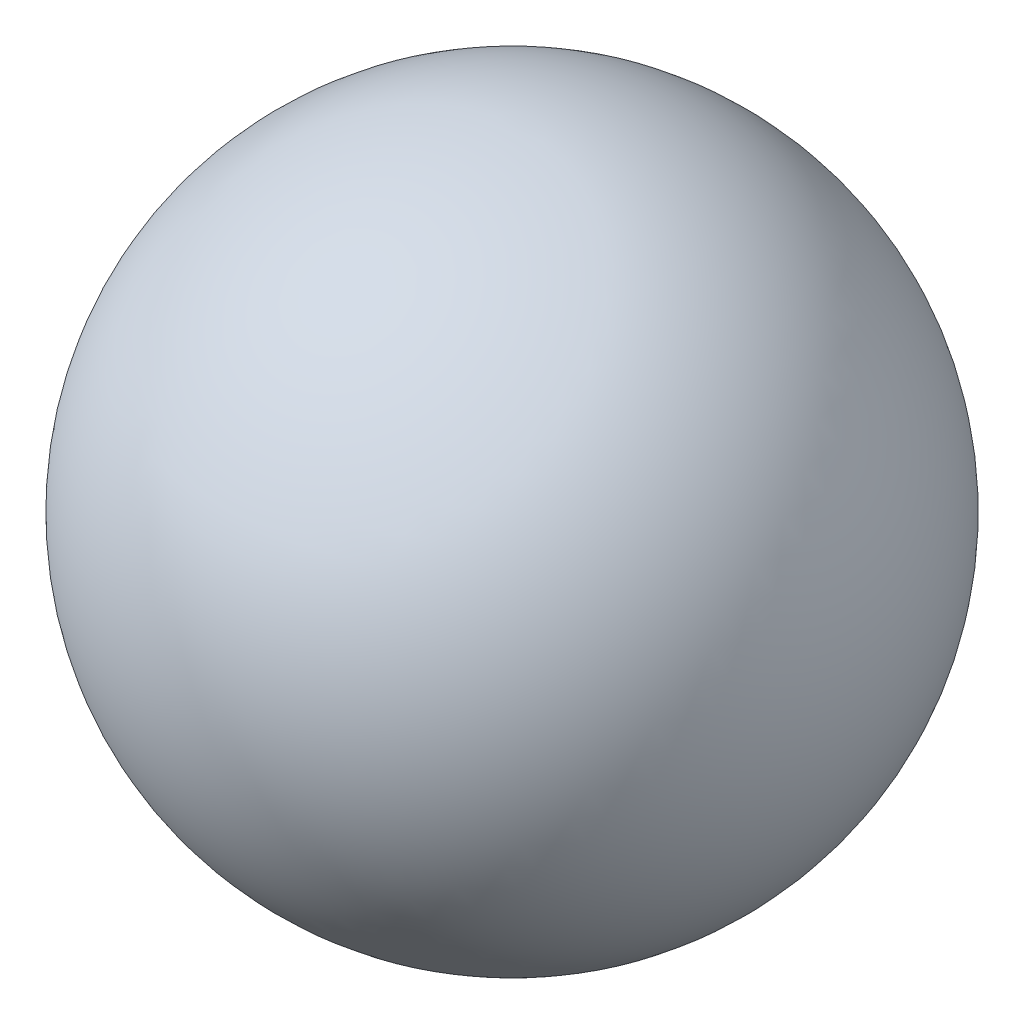
ISO-10303-21;
HEADER;
FILE_DESCRIPTION(('STEP AP214'),'2;1');
FILE_NAME('part.step','',(''),(''),'','','');
FILE_SCHEMA(('AUTOMOTIVE_DESIGN { 1 0 10303 214 1 1 1 1 }'));
ENDSEC;
DATA;
#1=APPLICATION_CONTEXT('core data for automotive mechanical design processes');
#2=APPLICATION_PROTOCOL_DEFINITION('international standard','automotive_design',2000,#1);
#3=PRODUCT_CONTEXT('',#1,'mechanical');
#4=PRODUCT('Part','Part','',(#3));
#5=PRODUCT_RELATED_PRODUCT_CATEGORY('part','',(#4));
#6=PRODUCT_DEFINITION_FORMATION('','',#4);
#7=PRODUCT_DEFINITION_CONTEXT('part definition',#1,'design');
#8=PRODUCT_DEFINITION('design','',#6,#7);
#9=PRODUCT_DEFINITION_SHAPE('','',#8);
#10=(LENGTH_UNIT() NAMED_UNIT(*) SI_UNIT(.MILLI.,.METRE.));
#11=(NAMED_UNIT(*) PLANE_ANGLE_UNIT() SI_UNIT($,.RADIAN.));
#12=(NAMED_UNIT(*) SI_UNIT($,.STERADIAN.) SOLID_ANGLE_UNIT());
#13=UNCERTAINTY_MEASURE_WITH_UNIT(LENGTH_MEASURE(1.E-05),#10,'distance_accuracy_value','');
#14=(GEOMETRIC_REPRESENTATION_CONTEXT(3) GLOBAL_UNCERTAINTY_ASSIGNED_CONTEXT((#13)) GLOBAL_UNIT_ASSIGNED_CONTEXT((#10,
#11,#12)) REPRESENTATION_CONTEXT('',''));
#15=CARTESIAN_POINT('',(0.,0.,0.));
#16=DIRECTION('',(0.,0.,1.));
#17=DIRECTION('',(1.,0.,0.));
#18=AXIS2_PLACEMENT_3D('',#15,#16,#17);
#19=CARTESIAN_POINT('',(0.,0.,0.));
#20=DIRECTION('',(0.,1.,0.));
#21=DIRECTION('',(1.,0.,0.));
#22=AXIS2_PLACEMENT_3D('',#19,#20,#21);
#23=SPHERICAL_SURFACE('',#22,75.);
#24=CARTESIAN_POINT('',(0.,75.,0.));
#25=VERTEX_POINT('',#24);
#26=VERTEX_LOOP('',#25);
#27=FACE_BOUND('',#26,.T.);
#28=ADVANCED_FACE('F29',(#27),#23,.T.);
#29=CLOSED_SHELL('',(#28));
#30=MANIFOLD_SOLID_BREP('B2',#29);
#31=ADVANCED_BREP_SHAPE_REPRESENTATION('',(#18,#30),#14);
#32=SHAPE_DEFINITION_REPRESENTATION(#9,#31);
ENDSEC;
END-ISO-10303-21;
